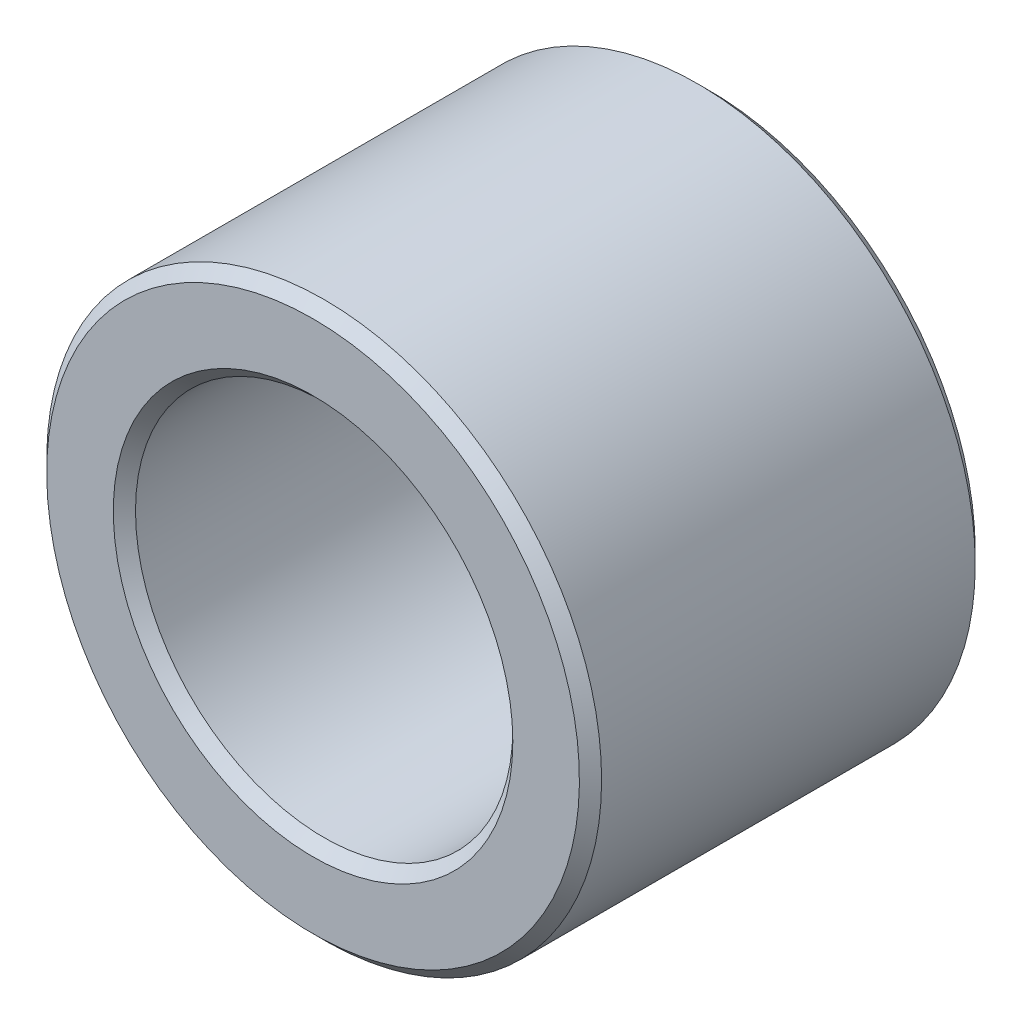
ISO-10303-21;
HEADER;
FILE_DESCRIPTION(('STEP AP214'),'2;1');
FILE_NAME('part.step','',(''),(''),'','','');
FILE_SCHEMA(('AUTOMOTIVE_DESIGN { 1 0 10303 214 1 1 1 1 }'));
ENDSEC;
DATA;
#1=APPLICATION_CONTEXT('core data for automotive mechanical design processes');
#2=APPLICATION_PROTOCOL_DEFINITION('international standard','automotive_design',2000,#1);
#3=PRODUCT_CONTEXT('',#1,'mechanical');
#4=PRODUCT('Part','Part','',(#3));
#5=PRODUCT_RELATED_PRODUCT_CATEGORY('part','',(#4));
#6=PRODUCT_DEFINITION_FORMATION('','',#4);
#7=PRODUCT_DEFINITION_CONTEXT('part definition',#1,'design');
#8=PRODUCT_DEFINITION('design','',#6,#7);
#9=PRODUCT_DEFINITION_SHAPE('','',#8);
#10=(LENGTH_UNIT() NAMED_UNIT(*) SI_UNIT(.MILLI.,.METRE.));
#11=(NAMED_UNIT(*) PLANE_ANGLE_UNIT() SI_UNIT($,.RADIAN.));
#12=(NAMED_UNIT(*) SI_UNIT($,.STERADIAN.) SOLID_ANGLE_UNIT());
#13=UNCERTAINTY_MEASURE_WITH_UNIT(LENGTH_MEASURE(1.E-05),#10,'distance_accuracy_value','');
#14=(GEOMETRIC_REPRESENTATION_CONTEXT(3) GLOBAL_UNCERTAINTY_ASSIGNED_CONTEXT((#13)) GLOBAL_UNIT_ASSIGNED_CONTEXT((#10,
#11,#12)) REPRESENTATION_CONTEXT('',''));
#15=CARTESIAN_POINT('',(0.,0.,0.));
#16=DIRECTION('',(0.,0.,1.));
#17=DIRECTION('',(1.,0.,0.));
#18=AXIS2_PLACEMENT_3D('',#15,#16,#17);
#19=CARTESIAN_POINT('',(0.,0.,0.));
#20=DIRECTION('',(0.,0.,1.));
#21=DIRECTION('',(1.,0.,0.));
#22=AXIS2_PLACEMENT_3D('',#19,#20,#21);
#23=CYLINDRICAL_SURFACE('',#22,6.477);
#24=CARTESIAN_POINT('',(0.,0.,0.381000000174936));
#25=DIRECTION('',(0.,0.,-1.));
#26=DIRECTION('',(-1.,0.,0.));
#27=AXIS2_PLACEMENT_3D('',#24,#25,#26);
#28=CIRCLE('',#27,6.47700000013174);
#29=CARTESIAN_POINT('',(-6.47700000013174,0.,0.381000000174936));
#30=VERTEX_POINT('',#29);
#31=EDGE_CURVE('E34',#30,#30,#28,.T.);
#32=ORIENTED_EDGE('',*,*,#31,.T.);
#33=EDGE_LOOP('',(#32));
#34=FACE_BOUND('',#33,.T.);
#35=CARTESIAN_POINT('',(0.,0.,13.2079999997927));
#36=DIRECTION('',(0.,0.,1.));
#37=DIRECTION('',(-1.,0.,0.));
#38=AXIS2_PLACEMENT_3D('',#35,#36,#37);
#39=CIRCLE('',#38,6.47700000018858);
#40=CARTESIAN_POINT('',(-6.47700000018858,0.,13.2079999997927));
#41=VERTEX_POINT('',#40);
#42=EDGE_CURVE('E37',#41,#41,#39,.T.);
#43=ORIENTED_EDGE('',*,*,#42,.T.);
#44=EDGE_LOOP('',(#43));
#45=FACE_BOUND('',#44,.T.);
#46=ADVANCED_FACE('F15',(#34,#45),#23,.F.);
#47=CARTESIAN_POINT('',(0.,0.,13.589000000195));
#48=DIRECTION('',(0.,0.,1.));
#49=DIRECTION('',(1.,0.,0.));
#50=AXIS2_PLACEMENT_3D('',#47,#48,#49);
#51=CONICAL_SURFACE('',#50,6.85799999990877,0.785398162502276);
#52=CARTESIAN_POINT('',(0.,0.,13.5890000001382));
#53=DIRECTION('',(0.,0.,1.));
#54=DIRECTION('',(1.,0.,0.));
#55=AXIS2_PLACEMENT_3D('',#52,#53,#54);
#56=CIRCLE('',#55,6.85799999985193);
#57=CARTESIAN_POINT('',(6.85799999985193,0.,13.5890000001382));
#58=VERTEX_POINT('',#57);
#59=EDGE_CURVE('E18',#58,#58,#56,.T.);
#60=ORIENTED_EDGE('',*,*,#59,.T.);
#61=EDGE_LOOP('',(#60));
#62=FACE_BOUND('',#61,.T.);
#63=ORIENTED_EDGE('',*,*,#42,.F.);
#64=EDGE_LOOP('',(#63));
#65=FACE_BOUND('',#64,.T.);
#66=ADVANCED_FACE('F55',(#62,#65),#51,.F.);
#67=CARTESIAN_POINT('',(0.,0.,-1.70530256582424E-10));
#68=DIRECTION('',(0.,0.,-1.));
#69=DIRECTION('',(-1.,0.,0.));
#70=AXIS2_PLACEMENT_3D('',#67,#68,#69);
#71=CONICAL_SURFACE('',#70,6.85799999979508,0.785398162502276);
#72=CARTESIAN_POINT('',(0.,0.,-1.70530256582424E-10));
#73=DIRECTION('',(0.,0.,-1.));
#74=DIRECTION('',(-1.,0.,0.));
#75=AXIS2_PLACEMENT_3D('',#72,#73,#74);
#76=CIRCLE('',#75,6.85799999979508);
#77=CARTESIAN_POINT('',(-6.85799999979508,0.,-1.70530256582424E-10));
#78=VERTEX_POINT('',#77);
#79=EDGE_CURVE('E48',#78,#78,#76,.F.);
#80=ORIENTED_EDGE('',*,*,#79,.F.);
#81=EDGE_LOOP('',(#80));
#82=FACE_BOUND('',#81,.T.);
#83=ORIENTED_EDGE('',*,*,#31,.F.);
#84=EDGE_LOOP('',(#83));
#85=FACE_BOUND('',#84,.T.);
#86=ADVANCED_FACE('F62',(#82,#85),#71,.F.);
#87=CARTESIAN_POINT('',(0.,0.,13.589));
#88=DIRECTION('',(0.,0.,-1.));
#89=DIRECTION('',(-1.,0.,0.));
#90=AXIS2_PLACEMENT_3D('',#87,#88,#89);
#91=PLANE('',#90);
#92=ORIENTED_EDGE('',*,*,#59,.F.);
#93=EDGE_LOOP('',(#92));
#94=FACE_BOUND('',#93,.T.);
#95=CARTESIAN_POINT('',(0.,0.,13.589000000171));
#96=DIRECTION('',(0.,0.,-1.));
#97=DIRECTION('',(0.,1.,0.));
#98=AXIS2_PLACEMENT_3D('',#95,#96,#97);
#99=CIRCLE('',#98,9.14400000017096);
#100=CARTESIAN_POINT('',(0.,9.14400000017096,13.589000000171));
#101=VERTEX_POINT('',#100);
#102=EDGE_CURVE('E46',#101,#101,#99,.T.);
#103=ORIENTED_EDGE('',*,*,#102,.F.);
#104=EDGE_LOOP('',(#103));
#105=FACE_BOUND('',#104,.T.);
#106=ADVANCED_FACE('F58',(#94,#105),#91,.F.);
#107=CARTESIAN_POINT('',(0.,0.,0.));
#108=DIRECTION('',(0.,0.,-1.));
#109=DIRECTION('',(-1.,0.,0.));
#110=AXIS2_PLACEMENT_3D('',#107,#108,#109);
#111=PLANE('',#110);
#112=ORIENTED_EDGE('',*,*,#79,.T.);
#113=EDGE_LOOP('',(#112));
#114=FACE_BOUND('',#113,.T.);
#115=CARTESIAN_POINT('',(0.,0.,-1.70963612190767E-10));
#116=DIRECTION('',(0.,0.,1.));
#117=DIRECTION('',(1.,0.,0.));
#118=AXIS2_PLACEMENT_3D('',#115,#116,#117);
#119=CIRCLE('',#118,9.14400000017097);
#120=CARTESIAN_POINT('',(9.14400000017097,0.,-1.70963612190767E-10));
#121=VERTEX_POINT('',#120);
#122=EDGE_CURVE('E27',#121,#121,#119,.T.);
#123=ORIENTED_EDGE('',*,*,#122,.F.);
#124=EDGE_LOOP('',(#123));
#125=FACE_BOUND('',#124,.T.);
#126=ADVANCED_FACE('F61',(#114,#125),#111,.T.);
#127=CARTESIAN_POINT('',(0.,0.,13.207999999829));
#128=DIRECTION('',(0.,0.,-1.));
#129=DIRECTION('',(0.,1.,0.));
#130=AXIS2_PLACEMENT_3D('',#127,#128,#129);
#131=CONICAL_SURFACE('',#130,9.52499999982904,0.7853981625);
#132=CARTESIAN_POINT('',(0.,0.,13.208));
#133=DIRECTION('',(0.,0.,1.));
#134=DIRECTION('',(1.,0.,0.));
#135=AXIS2_PLACEMENT_3D('',#132,#133,#134);
#136=CIRCLE('',#135,9.525);
#137=CARTESIAN_POINT('',(9.525,0.,13.208));
#138=VERTEX_POINT('',#137);
#139=EDGE_CURVE('E22',#138,#138,#136,.F.);
#140=ORIENTED_EDGE('',*,*,#139,.F.);
#141=EDGE_LOOP('',(#140));
#142=FACE_BOUND('',#141,.T.);
#143=ORIENTED_EDGE('',*,*,#102,.T.);
#144=EDGE_LOOP('',(#143));
#145=FACE_BOUND('',#144,.T.);
#146=ADVANCED_FACE('F66',(#142,#145),#131,.T.);
#147=CARTESIAN_POINT('',(0.,0.,0.381000000170965));
#148=DIRECTION('',(0.,0.,1.));
#149=DIRECTION('',(1.,0.,0.));
#150=AXIS2_PLACEMENT_3D('',#147,#148,#149);
#151=CONICAL_SURFACE('',#150,9.52499999982904,0.7853981625);
#152=ORIENTED_EDGE('',*,*,#122,.T.);
#153=EDGE_LOOP('',(#152));
#154=FACE_BOUND('',#153,.T.);
#155=CARTESIAN_POINT('',(0.,0.,0.381));
#156=DIRECTION('',(0.,0.,1.));
#157=DIRECTION('',(1.,0.,0.));
#158=AXIS2_PLACEMENT_3D('',#155,#156,#157);
#159=CIRCLE('',#158,9.525);
#160=CARTESIAN_POINT('',(9.525,0.,0.381));
#161=VERTEX_POINT('',#160);
#162=EDGE_CURVE('E10',#161,#161,#159,.T.);
#163=ORIENTED_EDGE('',*,*,#162,.F.);
#164=EDGE_LOOP('',(#163));
#165=FACE_BOUND('',#164,.T.);
#166=ADVANCED_FACE('F68',(#154,#165),#151,.T.);
#167=CARTESIAN_POINT('',(0.,0.,0.));
#168=DIRECTION('',(0.,0.,1.));
#169=DIRECTION('',(1.,0.,0.));
#170=AXIS2_PLACEMENT_3D('',#167,#168,#169);
#171=CYLINDRICAL_SURFACE('',#170,9.525);
#172=ORIENTED_EDGE('',*,*,#162,.T.);
#173=EDGE_LOOP('',(#172));
#174=FACE_BOUND('',#173,.T.);
#175=ORIENTED_EDGE('',*,*,#139,.T.);
#176=EDGE_LOOP('',(#175));
#177=FACE_BOUND('',#176,.T.);
#178=ADVANCED_FACE('F76',(#174,#177),#171,.T.);
#179=CLOSED_SHELL('',(#46,#66,#86,#106,#126,#146,#166,#178));
#180=MANIFOLD_SOLID_BREP('B1',#179);
#181=ADVANCED_BREP_SHAPE_REPRESENTATION('',(#18,#180),#14);
#182=SHAPE_DEFINITION_REPRESENTATION(#9,#181);
ENDSEC;
END-ISO-10303-21;
